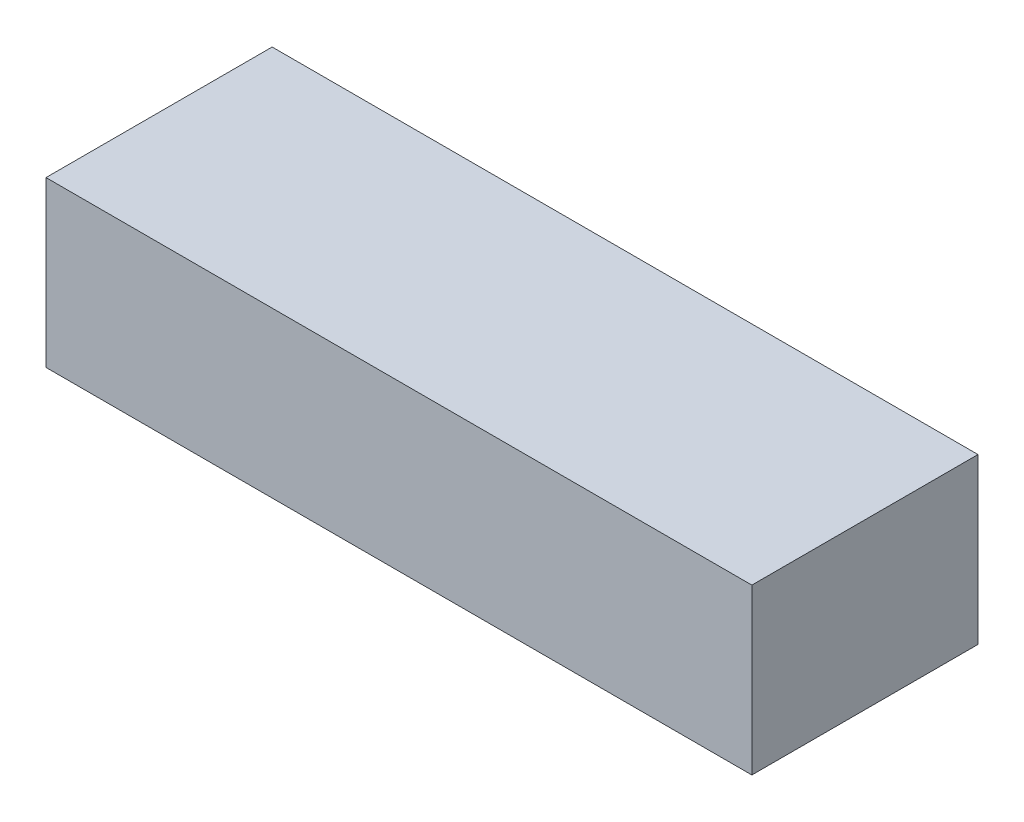
ISO-10303-21;
HEADER;
FILE_DESCRIPTION(('STEP AP214'),'2;1');
FILE_NAME('part.step','',(''),(''),'','','');
FILE_SCHEMA(('AUTOMOTIVE_DESIGN { 1 0 10303 214 1 1 1 1 }'));
ENDSEC;
DATA;
#1=APPLICATION_CONTEXT('core data for automotive mechanical design processes');
#2=APPLICATION_PROTOCOL_DEFINITION('international standard','automotive_design',2000,#1);
#3=PRODUCT_CONTEXT('',#1,'mechanical');
#4=PRODUCT('Part','Part','',(#3));
#5=PRODUCT_RELATED_PRODUCT_CATEGORY('part','',(#4));
#6=PRODUCT_DEFINITION_FORMATION('','',#4);
#7=PRODUCT_DEFINITION_CONTEXT('part definition',#1,'design');
#8=PRODUCT_DEFINITION('design','',#6,#7);
#9=PRODUCT_DEFINITION_SHAPE('','',#8);
#10=(LENGTH_UNIT() NAMED_UNIT(*) SI_UNIT(.MILLI.,.METRE.));
#11=(NAMED_UNIT(*) PLANE_ANGLE_UNIT() SI_UNIT($,.RADIAN.));
#12=(NAMED_UNIT(*) SI_UNIT($,.STERADIAN.) SOLID_ANGLE_UNIT());
#13=UNCERTAINTY_MEASURE_WITH_UNIT(LENGTH_MEASURE(1.E-05),#10,'distance_accuracy_value','');
#14=(GEOMETRIC_REPRESENTATION_CONTEXT(3) GLOBAL_UNCERTAINTY_ASSIGNED_CONTEXT((#13)) GLOBAL_UNIT_ASSIGNED_CONTEXT((#10,
#11,#12)) REPRESENTATION_CONTEXT('',''));
#15=CARTESIAN_POINT('',(0.,0.,0.));
#16=DIRECTION('',(0.,0.,1.));
#17=DIRECTION('',(1.,0.,0.));
#18=AXIS2_PLACEMENT_3D('',#15,#16,#17);
#19=CARTESIAN_POINT('',(51.5,24.,16.5));
#20=DIRECTION('',(-1.,0.,0.));
#21=DIRECTION('',(0.,0.,1.));
#22=AXIS2_PLACEMENT_3D('',#19,#20,#21);
#23=PLANE('',#22);
#24=DIRECTION('',(0.,0.,-1.));
#25=VECTOR('',#24,1.);
#26=CARTESIAN_POINT('',(51.5,0.,16.5));
#27=LINE('',#26,#25);
#28=CARTESIAN_POINT('',(51.5,0.,16.5));
#29=VERTEX_POINT('',#28);
#30=CARTESIAN_POINT('',(51.5,0.,-16.5));
#31=VERTEX_POINT('',#30);
#32=EDGE_CURVE('E99',#29,#31,#27,.T.);
#33=ORIENTED_EDGE('',*,*,#32,.T.);
#34=DIRECTION('',(0.,-1.,0.));
#35=VECTOR('',#34,1.);
#36=CARTESIAN_POINT('',(51.5,24.,-16.5));
#37=LINE('',#36,#35);
#38=CARTESIAN_POINT('',(51.5,24.,-16.5));
#39=VERTEX_POINT('',#38);
#40=EDGE_CURVE('E11',#39,#31,#37,.T.);
#41=ORIENTED_EDGE('',*,*,#40,.F.);
#42=DIRECTION('',(0.,0.,-1.));
#43=VECTOR('',#42,1.);
#44=CARTESIAN_POINT('',(51.5,24.,16.5));
#45=LINE('',#44,#43);
#46=CARTESIAN_POINT('',(51.5,24.,16.5));
#47=VERTEX_POINT('',#46);
#48=EDGE_CURVE('E87',#47,#39,#45,.T.);
#49=ORIENTED_EDGE('',*,*,#48,.F.);
#50=DIRECTION('',(0.,-1.,0.));
#51=VECTOR('',#50,1.);
#52=CARTESIAN_POINT('',(51.5,24.,16.5));
#53=LINE('',#52,#51);
#54=EDGE_CURVE('E95',#47,#29,#53,.T.);
#55=ORIENTED_EDGE('',*,*,#54,.T.);
#56=EDGE_LOOP('',(#33,#41,#49,#55));
#57=FACE_BOUND('',#56,.T.);
#58=ADVANCED_FACE('F36',(#57),#23,.F.);
#59=CARTESIAN_POINT('',(-51.5,24.,-16.5));
#60=DIRECTION('',(0.,0.,1.));
#61=DIRECTION('',(1.,0.,0.));
#62=AXIS2_PLACEMENT_3D('',#59,#60,#61);
#63=PLANE('',#62);
#64=DIRECTION('',(-1.,0.,0.));
#65=VECTOR('',#64,1.);
#66=CARTESIAN_POINT('',(-51.5,0.,-16.5));
#67=LINE('',#66,#65);
#68=CARTESIAN_POINT('',(-51.5,0.,-16.5));
#69=VERTEX_POINT('',#68);
#70=EDGE_CURVE('E91',#31,#69,#67,.T.);
#71=ORIENTED_EDGE('',*,*,#70,.T.);
#72=DIRECTION('',(0.,-1.,0.));
#73=VECTOR('',#72,1.);
#74=CARTESIAN_POINT('',(-51.5,24.,-16.5));
#75=LINE('',#74,#73);
#76=CARTESIAN_POINT('',(-51.5,24.,-16.5));
#77=VERTEX_POINT('',#76);
#78=EDGE_CURVE('E44',#77,#69,#75,.T.);
#79=ORIENTED_EDGE('',*,*,#78,.F.);
#80=DIRECTION('',(-1.,0.,0.));
#81=VECTOR('',#80,1.);
#82=CARTESIAN_POINT('',(-51.5,24.,-16.5));
#83=LINE('',#82,#81);
#84=EDGE_CURVE('E82',#39,#77,#83,.T.);
#85=ORIENTED_EDGE('',*,*,#84,.F.);
#86=ORIENTED_EDGE('',*,*,#40,.T.);
#87=EDGE_LOOP('',(#71,#79,#85,#86));
#88=FACE_BOUND('',#87,.T.);
#89=ADVANCED_FACE('F90',(#88),#63,.F.);
#90=CARTESIAN_POINT('',(-51.5,24.,16.5));
#91=DIRECTION('',(1.,0.,0.));
#92=DIRECTION('',(0.,0.,-1.));
#93=AXIS2_PLACEMENT_3D('',#90,#91,#92);
#94=PLANE('',#93);
#95=DIRECTION('',(0.,0.,1.));
#96=VECTOR('',#95,1.);
#97=CARTESIAN_POINT('',(-51.5,0.,16.5));
#98=LINE('',#97,#96);
#99=CARTESIAN_POINT('',(-51.5,0.,16.5));
#100=VERTEX_POINT('',#99);
#101=EDGE_CURVE('E69',#69,#100,#98,.T.);
#102=ORIENTED_EDGE('',*,*,#101,.T.);
#103=DIRECTION('',(0.,-1.,0.));
#104=VECTOR('',#103,1.);
#105=CARTESIAN_POINT('',(-51.5,24.,16.5));
#106=LINE('',#105,#104);
#107=CARTESIAN_POINT('',(-51.5,24.,16.5));
#108=VERTEX_POINT('',#107);
#109=EDGE_CURVE('E92',#108,#100,#106,.T.);
#110=ORIENTED_EDGE('',*,*,#109,.F.);
#111=DIRECTION('',(0.,0.,1.));
#112=VECTOR('',#111,1.);
#113=CARTESIAN_POINT('',(-51.5,24.,16.5));
#114=LINE('',#113,#112);
#115=EDGE_CURVE('E85',#77,#108,#114,.T.);
#116=ORIENTED_EDGE('',*,*,#115,.F.);
#117=ORIENTED_EDGE('',*,*,#78,.T.);
#118=EDGE_LOOP('',(#102,#110,#116,#117));
#119=FACE_BOUND('',#118,.T.);
#120=ADVANCED_FACE('F93',(#119),#94,.F.);
#121=CARTESIAN_POINT('',(-51.5,24.,16.5));
#122=DIRECTION('',(0.,0.,-1.));
#123=DIRECTION('',(-1.,0.,0.));
#124=AXIS2_PLACEMENT_3D('',#121,#122,#123);
#125=PLANE('',#124);
#126=DIRECTION('',(1.,0.,0.));
#127=VECTOR('',#126,1.);
#128=CARTESIAN_POINT('',(-51.5,0.,16.5));
#129=LINE('',#128,#127);
#130=EDGE_CURVE('E75',#100,#29,#129,.T.);
#131=ORIENTED_EDGE('',*,*,#130,.T.);
#132=ORIENTED_EDGE('',*,*,#54,.F.);
#133=DIRECTION('',(1.,0.,0.));
#134=VECTOR('',#133,1.);
#135=CARTESIAN_POINT('',(-51.5,24.,16.5));
#136=LINE('',#135,#134);
#137=EDGE_CURVE('E52',#108,#47,#136,.T.);
#138=ORIENTED_EDGE('',*,*,#137,.F.);
#139=ORIENTED_EDGE('',*,*,#109,.T.);
#140=EDGE_LOOP('',(#131,#132,#138,#139));
#141=FACE_BOUND('',#140,.T.);
#142=ADVANCED_FACE('F106',(#141),#125,.F.);
#143=CARTESIAN_POINT('',(0.,24.,0.));
#144=DIRECTION('',(0.,-1.,0.));
#145=DIRECTION('',(0.,0.,-1.));
#146=AXIS2_PLACEMENT_3D('',#143,#144,#145);
#147=PLANE('',#146);
#148=ORIENTED_EDGE('',*,*,#48,.T.);
#149=ORIENTED_EDGE('',*,*,#84,.T.);
#150=ORIENTED_EDGE('',*,*,#115,.T.);
#151=ORIENTED_EDGE('',*,*,#137,.T.);
#152=EDGE_LOOP('',(#148,#149,#150,#151));
#153=FACE_BOUND('',#152,.T.);
#154=ADVANCED_FACE('F83',(#153),#147,.F.);
#155=CARTESIAN_POINT('',(0.,0.,0.));
#156=DIRECTION('',(0.,-1.,0.));
#157=DIRECTION('',(0.,0.,-1.));
#158=AXIS2_PLACEMENT_3D('',#155,#156,#157);
#159=PLANE('',#158);
#160=ORIENTED_EDGE('',*,*,#32,.F.);
#161=ORIENTED_EDGE('',*,*,#130,.F.);
#162=ORIENTED_EDGE('',*,*,#101,.F.);
#163=ORIENTED_EDGE('',*,*,#70,.F.);
#164=EDGE_LOOP('',(#160,#161,#162,#163));
#165=FACE_BOUND('',#164,.T.);
#166=ADVANCED_FACE('F109',(#165),#159,.T.);
#167=CLOSED_SHELL('',(#58,#89,#120,#142,#154,#166));
#168=MANIFOLD_SOLID_BREP('B2',#167);
#169=ADVANCED_BREP_SHAPE_REPRESENTATION('',(#18,#168),#14);
#170=SHAPE_DEFINITION_REPRESENTATION(#9,#169);
ENDSEC;
END-ISO-10303-21;
